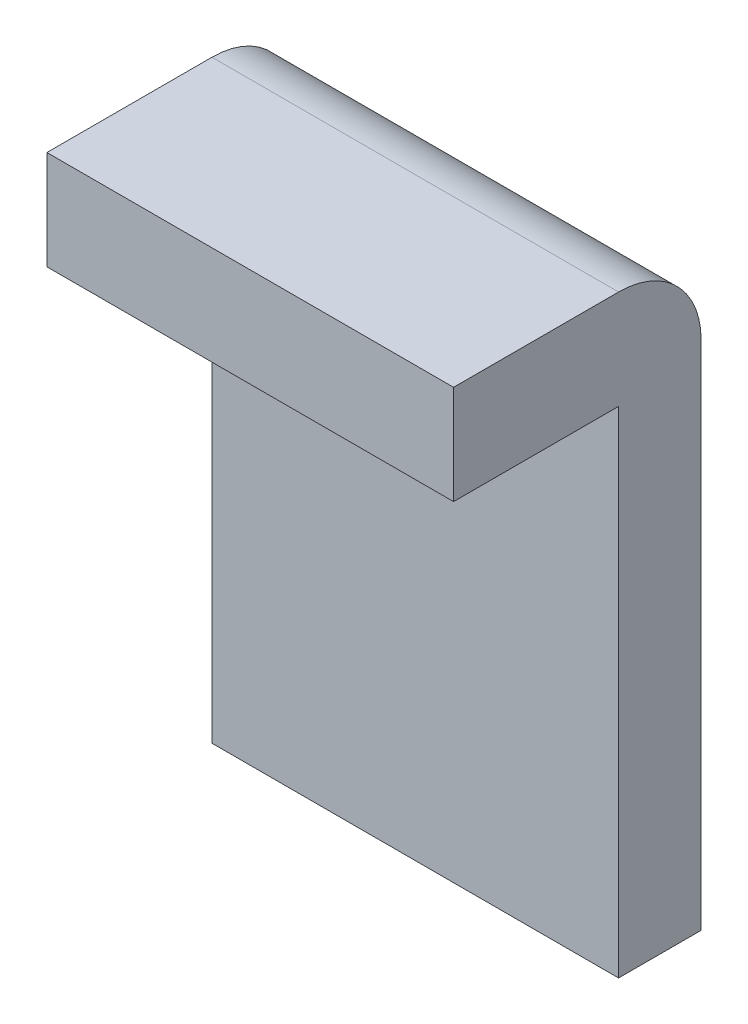
ISO-10303-21;
HEADER;
FILE_DESCRIPTION(('STEP AP214'),'2;1');
FILE_NAME('part.step','',(''),(''),'','','');
FILE_SCHEMA(('AUTOMOTIVE_DESIGN { 1 0 10303 214 1 1 1 1 }'));
ENDSEC;
DATA;
#1=APPLICATION_CONTEXT('core data for automotive mechanical design processes');
#2=APPLICATION_PROTOCOL_DEFINITION('international standard','automotive_design',2000,#1);
#3=PRODUCT_CONTEXT('',#1,'mechanical');
#4=PRODUCT('Part','Part','',(#3));
#5=PRODUCT_RELATED_PRODUCT_CATEGORY('part','',(#4));
#6=PRODUCT_DEFINITION_FORMATION('','',#4);
#7=PRODUCT_DEFINITION_CONTEXT('part definition',#1,'design');
#8=PRODUCT_DEFINITION('design','',#6,#7);
#9=PRODUCT_DEFINITION_SHAPE('','',#8);
#10=(LENGTH_UNIT() NAMED_UNIT(*) SI_UNIT(.MILLI.,.METRE.));
#11=(NAMED_UNIT(*) PLANE_ANGLE_UNIT() SI_UNIT($,.RADIAN.));
#12=(NAMED_UNIT(*) SI_UNIT($,.STERADIAN.) SOLID_ANGLE_UNIT());
#13=UNCERTAINTY_MEASURE_WITH_UNIT(LENGTH_MEASURE(1.E-05),#10,'distance_accuracy_value','');
#14=(GEOMETRIC_REPRESENTATION_CONTEXT(3) GLOBAL_UNCERTAINTY_ASSIGNED_CONTEXT((#13)) GLOBAL_UNIT_ASSIGNED_CONTEXT((#10,
#11,#12)) REPRESENTATION_CONTEXT('',''));
#15=CARTESIAN_POINT('',(0.,0.,0.));
#16=DIRECTION('',(0.,0.,1.));
#17=DIRECTION('',(1.,0.,0.));
#18=AXIS2_PLACEMENT_3D('',#15,#16,#17);
#19=CARTESIAN_POINT('',(-8.34906661620967,8.30000000000001,4.25467377707551));
#20=DIRECTION('',(0.,1.,0.));
#21=DIRECTION('',(0.,0.,1.));
#22=AXIS2_PLACEMENT_3D('',#19,#20,#21);
#23=PLANE('',#22);
#24=DIRECTION('',(1.,0.,0.));
#25=VECTOR('',#24,1.);
#26=CARTESIAN_POINT('',(4.14560885986157,8.30000000000001,4.25467377707552));
#27=LINE('',#26,#25);
#28=CARTESIAN_POINT('',(4.14560885986157,8.30000000000001,4.25467377707551));
#29=VERTEX_POINT('',#28);
#30=CARTESIAN_POINT('',(5.3777596163023,8.30000000000001,4.25467377707551));
#31=VERTEX_POINT('',#30);
#32=EDGE_CURVE('E133',#29,#31,#27,.T.);
#33=ORIENTED_EDGE('',*,*,#32,.F.);
#34=DIRECTION('',(0.,0.,1.));
#35=VECTOR('',#34,1.);
#36=CARTESIAN_POINT('',(4.14560885986157,8.30000000000001,4.25467377707553));
#37=LINE('',#36,#35);
#38=CARTESIAN_POINT('',(4.14560885986157,8.30000000000001,3.75467377707551));
#39=VERTEX_POINT('',#38);
#40=EDGE_CURVE('E113',#39,#29,#37,.T.);
#41=ORIENTED_EDGE('',*,*,#40,.F.);
#42=DIRECTION('',(1.,0.,0.));
#43=VECTOR('',#42,1.);
#44=CARTESIAN_POINT('',(-8.34906661620967,8.30000000000001,3.75467377707551));
#45=LINE('',#44,#43);
#46=CARTESIAN_POINT('',(5.3777596163023,8.30000000000001,3.75467377707551));
#47=VERTEX_POINT('',#46);
#48=EDGE_CURVE('E130',#39,#47,#45,.T.);
#49=ORIENTED_EDGE('',*,*,#48,.T.);
#50=DIRECTION('',(0.,0.,-1.));
#51=VECTOR('',#50,1.);
#52=CARTESIAN_POINT('',(5.3777596163023,8.30000000000001,4.25467377707553));
#53=LINE('',#52,#51);
#54=EDGE_CURVE('E129',#31,#47,#53,.T.);
#55=ORIENTED_EDGE('',*,*,#54,.F.);
#56=EDGE_LOOP('',(#33,#41,#49,#55));
#57=FACE_BOUND('',#56,.T.);
#58=ADVANCED_FACE('F17',(#57),#23,.F.);
#59=CARTESIAN_POINT('',(4.14560885986157,5.35753839337144,4.25467377707553));
#60=DIRECTION('',(0.,0.,1.));
#61=DIRECTION('',(0.,-1.,0.));
#62=AXIS2_PLACEMENT_3D('',#59,#60,#61);
#63=PLANE('',#62);
#64=DIRECTION('',(1.,0.,0.));
#65=VECTOR('',#64,1.);
#66=CARTESIAN_POINT('',(-8.34906661620967,8.6,4.25467377707551));
#67=LINE('',#66,#65);
#68=CARTESIAN_POINT('',(5.3777596163023,8.6,4.25467377707551));
#69=VERTEX_POINT('',#68);
#70=CARTESIAN_POINT('',(4.14560885986157,8.6,4.25467377707551));
#71=VERTEX_POINT('',#70);
#72=EDGE_CURVE('E131',#69,#71,#67,.F.);
#73=ORIENTED_EDGE('',*,*,#72,.T.);
#74=DIRECTION('',(0.,1.,0.));
#75=VECTOR('',#74,1.);
#76=CARTESIAN_POINT('',(4.14560885986157,5.35753839337144,4.25467377707551));
#77=LINE('',#76,#75);
#78=EDGE_CURVE('E136',#29,#71,#77,.T.);
#79=ORIENTED_EDGE('',*,*,#78,.F.);
#80=ORIENTED_EDGE('',*,*,#32,.T.);
#81=DIRECTION('',(0.,1.,0.));
#82=VECTOR('',#81,1.);
#83=CARTESIAN_POINT('',(5.3777596163023,5.35753839337144,4.25467377707551));
#84=LINE('',#83,#82);
#85=EDGE_CURVE('E120',#69,#31,#84,.F.);
#86=ORIENTED_EDGE('',*,*,#85,.F.);
#87=EDGE_LOOP('',(#73,#79,#80,#86));
#88=FACE_BOUND('',#87,.T.);
#89=ADVANCED_FACE('F172',(#88),#63,.T.);
#90=CARTESIAN_POINT('',(-8.34906661620967,8.6,4.25467377707551));
#91=DIRECTION('',(0.,-1.,0.));
#92=DIRECTION('',(0.,0.,-1.));
#93=AXIS2_PLACEMENT_3D('',#90,#91,#92);
#94=PLANE('',#93);
#95=DIRECTION('',(1.,0.,0.));
#96=VECTOR('',#95,1.);
#97=CARTESIAN_POINT('',(-8.34906661620967,8.6,3.75467377707551));
#98=LINE('',#97,#96);
#99=CARTESIAN_POINT('',(4.14560885986157,8.6,3.7546737770755));
#100=VERTEX_POINT('',#99);
#101=CARTESIAN_POINT('',(5.3777596163023,8.6,3.7546737770755));
#102=VERTEX_POINT('',#101);
#103=EDGE_CURVE('E79',#100,#102,#98,.T.);
#104=ORIENTED_EDGE('',*,*,#103,.F.);
#105=DIRECTION('',(0.,0.,1.));
#106=VECTOR('',#105,1.);
#107=CARTESIAN_POINT('',(4.14560885986157,8.6,4.25467377707553));
#108=LINE('',#107,#106);
#109=EDGE_CURVE('E139',#71,#100,#108,.F.);
#110=ORIENTED_EDGE('',*,*,#109,.F.);
#111=ORIENTED_EDGE('',*,*,#72,.F.);
#112=DIRECTION('',(0.,0.,-1.));
#113=VECTOR('',#112,1.);
#114=CARTESIAN_POINT('',(5.3777596163023,8.6,4.25467377707553));
#115=LINE('',#114,#113);
#116=EDGE_CURVE('E83',#102,#69,#115,.F.);
#117=ORIENTED_EDGE('',*,*,#116,.F.);
#118=EDGE_LOOP('',(#104,#110,#111,#117));
#119=FACE_BOUND('',#118,.T.);
#120=ADVANCED_FACE('F169',(#119),#94,.F.);
#121=CARTESIAN_POINT('',(-8.34906661620967,8.30000000000001,3.75467377707551));
#122=DIRECTION('',(0.,0.,-1.));
#123=DIRECTION('',(0.,1.,0.));
#124=AXIS2_PLACEMENT_3D('',#121,#122,#123);
#125=PLANE('',#124);
#126=ORIENTED_EDGE('',*,*,#48,.F.);
#127=DIRECTION('',(0.,1.,0.));
#128=VECTOR('',#127,1.);
#129=CARTESIAN_POINT('',(4.14560885986157,5.35753839337144,3.75467377707551));
#130=LINE('',#129,#128);
#131=CARTESIAN_POINT('',(4.14560885986157,6.8,3.75467377707551));
#132=VERTEX_POINT('',#131);
#133=EDGE_CURVE('E95',#132,#39,#130,.T.);
#134=ORIENTED_EDGE('',*,*,#133,.F.);
#135=DIRECTION('',(1.,0.,0.));
#136=VECTOR('',#135,1.);
#137=CARTESIAN_POINT('',(-15.8147962412963,6.8,3.75467377707551));
#138=LINE('',#137,#136);
#139=CARTESIAN_POINT('',(5.3777596163023,6.8,3.75467377707551));
#140=VERTEX_POINT('',#139);
#141=EDGE_CURVE('E114',#140,#132,#138,.F.);
#142=ORIENTED_EDGE('',*,*,#141,.F.);
#143=DIRECTION('',(0.,1.,0.));
#144=VECTOR('',#143,1.);
#145=CARTESIAN_POINT('',(5.3777596163023,5.35753839337144,3.75467377707551));
#146=LINE('',#145,#144);
#147=EDGE_CURVE('E84',#47,#140,#146,.F.);
#148=ORIENTED_EDGE('',*,*,#147,.F.);
#149=EDGE_LOOP('',(#126,#134,#142,#148));
#150=FACE_BOUND('',#149,.T.);
#151=ADVANCED_FACE('F178',(#150),#125,.F.);
#152=CARTESIAN_POINT('',(-8.34906661620967,8.35,3.7546737770755));
#153=DIRECTION('',(1.,0.,0.));
#154=DIRECTION('',(0.,0.,-1.));
#155=AXIS2_PLACEMENT_3D('',#152,#153,#154);
#156=CYLINDRICAL_SURFACE('',#155,0.249999999999996);
#157=CARTESIAN_POINT('',(4.14560885986157,8.35,3.7546737770755));
#158=DIRECTION('',(1.,0.,0.));
#159=DIRECTION('',(0.,0.,-1.));
#160=AXIS2_PLACEMENT_3D('',#157,#158,#159);
#161=CIRCLE('',#160,0.249999999999996);
#162=CARTESIAN_POINT('',(4.14560885986157,8.35,3.50467377707551));
#163=VERTEX_POINT('',#162);
#164=EDGE_CURVE('E106',#100,#163,#161,.F.);
#165=ORIENTED_EDGE('',*,*,#164,.F.);
#166=ORIENTED_EDGE('',*,*,#103,.T.);
#167=CARTESIAN_POINT('',(5.3777596163023,8.35,3.7546737770755));
#168=DIRECTION('',(1.,0.,0.));
#169=DIRECTION('',(0.,0.,-1.));
#170=AXIS2_PLACEMENT_3D('',#167,#168,#169);
#171=CIRCLE('',#170,0.249999999999996);
#172=CARTESIAN_POINT('',(5.3777596163023,8.35,3.50467377707551));
#173=VERTEX_POINT('',#172);
#174=EDGE_CURVE('E20',#173,#102,#171,.T.);
#175=ORIENTED_EDGE('',*,*,#174,.F.);
#176=DIRECTION('',(1.,0.,0.));
#177=VECTOR('',#176,1.);
#178=CARTESIAN_POINT('',(4.14560885986157,8.35,3.50467377707551));
#179=LINE('',#178,#177);
#180=EDGE_CURVE('E77',#163,#173,#179,.T.);
#181=ORIENTED_EDGE('',*,*,#180,.F.);
#182=EDGE_LOOP('',(#165,#166,#175,#181));
#183=FACE_BOUND('',#182,.T.);
#184=ADVANCED_FACE('F75',(#183),#156,.T.);
#185=CARTESIAN_POINT('',(5.3777596163023,5.35753839337144,4.25467377707553));
#186=DIRECTION('',(1.,0.,0.));
#187=DIRECTION('',(0.,0.,-1.));
#188=AXIS2_PLACEMENT_3D('',#185,#186,#187);
#189=PLANE('',#188);
#190=ORIENTED_EDGE('',*,*,#116,.T.);
#191=ORIENTED_EDGE('',*,*,#85,.T.);
#192=ORIENTED_EDGE('',*,*,#54,.T.);
#193=ORIENTED_EDGE('',*,*,#147,.T.);
#194=DIRECTION('',(0.,0.,-1.));
#195=VECTOR('',#194,1.);
#196=CARTESIAN_POINT('',(5.3777596163023,6.80000000000003,12.5046737770755));
#197=LINE('',#196,#195);
#198=CARTESIAN_POINT('',(5.3777596163023,6.8,3.50467377707552));
#199=VERTEX_POINT('',#198);
#200=EDGE_CURVE('E90',#199,#140,#197,.F.);
#201=ORIENTED_EDGE('',*,*,#200,.F.);
#202=DIRECTION('',(0.,1.,0.));
#203=VECTOR('',#202,1.);
#204=CARTESIAN_POINT('',(5.3777596163023,5.35753839337143,3.50467377707553));
#205=LINE('',#204,#203);
#206=EDGE_CURVE('E86',#173,#199,#205,.F.);
#207=ORIENTED_EDGE('',*,*,#206,.F.);
#208=ORIENTED_EDGE('',*,*,#174,.T.);
#209=EDGE_LOOP('',(#190,#191,#192,#193,#201,#207,#208));
#210=FACE_BOUND('',#209,.T.);
#211=ADVANCED_FACE('F87',(#210),#189,.T.);
#212=CARTESIAN_POINT('',(-15.8147962412963,6.80000000000003,12.5046737770755));
#213=DIRECTION('',(0.,-1.,0.));
#214=DIRECTION('',(0.,0.,-1.));
#215=AXIS2_PLACEMENT_3D('',#212,#213,#214);
#216=PLANE('',#215);
#217=DIRECTION('',(1.,0.,0.));
#218=VECTOR('',#217,1.);
#219=CARTESIAN_POINT('',(4.14560885986157,6.8,3.50467377707552));
#220=LINE('',#219,#218);
#221=CARTESIAN_POINT('',(4.14560885986157,6.8,3.50467377707552));
#222=VERTEX_POINT('',#221);
#223=EDGE_CURVE('E26',#199,#222,#220,.F.);
#224=ORIENTED_EDGE('',*,*,#223,.F.);
#225=ORIENTED_EDGE('',*,*,#200,.T.);
#226=ORIENTED_EDGE('',*,*,#141,.T.);
#227=DIRECTION('',(0.,0.,1.));
#228=VECTOR('',#227,1.);
#229=CARTESIAN_POINT('',(4.14560885986157,6.8,4.25467377707553));
#230=LINE('',#229,#228);
#231=EDGE_CURVE('E35',#222,#132,#230,.T.);
#232=ORIENTED_EDGE('',*,*,#231,.F.);
#233=EDGE_LOOP('',(#224,#225,#226,#232));
#234=FACE_BOUND('',#233,.T.);
#235=ADVANCED_FACE('F179',(#234),#216,.T.);
#236=CARTESIAN_POINT('',(4.14560885986157,5.35753839337144,4.25467377707553));
#237=DIRECTION('',(-1.,0.,0.));
#238=DIRECTION('',(0.,0.,1.));
#239=AXIS2_PLACEMENT_3D('',#236,#237,#238);
#240=PLANE('',#239);
#241=ORIENTED_EDGE('',*,*,#231,.T.);
#242=ORIENTED_EDGE('',*,*,#133,.T.);
#243=ORIENTED_EDGE('',*,*,#40,.T.);
#244=ORIENTED_EDGE('',*,*,#78,.T.);
#245=ORIENTED_EDGE('',*,*,#109,.T.);
#246=ORIENTED_EDGE('',*,*,#164,.T.);
#247=DIRECTION('',(0.,1.,0.));
#248=VECTOR('',#247,1.);
#249=CARTESIAN_POINT('',(4.14560885986157,5.35753839337143,3.50467377707553));
#250=LINE('',#249,#248);
#251=EDGE_CURVE('E11',#222,#163,#250,.T.);
#252=ORIENTED_EDGE('',*,*,#251,.F.);
#253=EDGE_LOOP('',(#241,#242,#243,#244,#245,#246,#252));
#254=FACE_BOUND('',#253,.T.);
#255=ADVANCED_FACE('F166',(#254),#240,.T.);
#256=CARTESIAN_POINT('',(4.14560885986157,5.35753839337143,3.50467377707553));
#257=DIRECTION('',(0.,0.,-1.));
#258=DIRECTION('',(0.,1.,0.));
#259=AXIS2_PLACEMENT_3D('',#256,#257,#258);
#260=PLANE('',#259);
#261=ORIENTED_EDGE('',*,*,#223,.T.);
#262=ORIENTED_EDGE('',*,*,#251,.T.);
#263=ORIENTED_EDGE('',*,*,#180,.T.);
#264=ORIENTED_EDGE('',*,*,#206,.T.);
#265=EDGE_LOOP('',(#261,#262,#263,#264));
#266=FACE_BOUND('',#265,.T.);
#267=ADVANCED_FACE('F94',(#266),#260,.T.);
#268=CLOSED_SHELL('',(#58,#89,#120,#151,#184,#211,#235,#255,#267));
#269=MANIFOLD_SOLID_BREP('B1',#268);
#270=ADVANCED_BREP_SHAPE_REPRESENTATION('',(#18,#269),#14);
#271=SHAPE_DEFINITION_REPRESENTATION(#9,#270);
ENDSEC;
END-ISO-10303-21;
